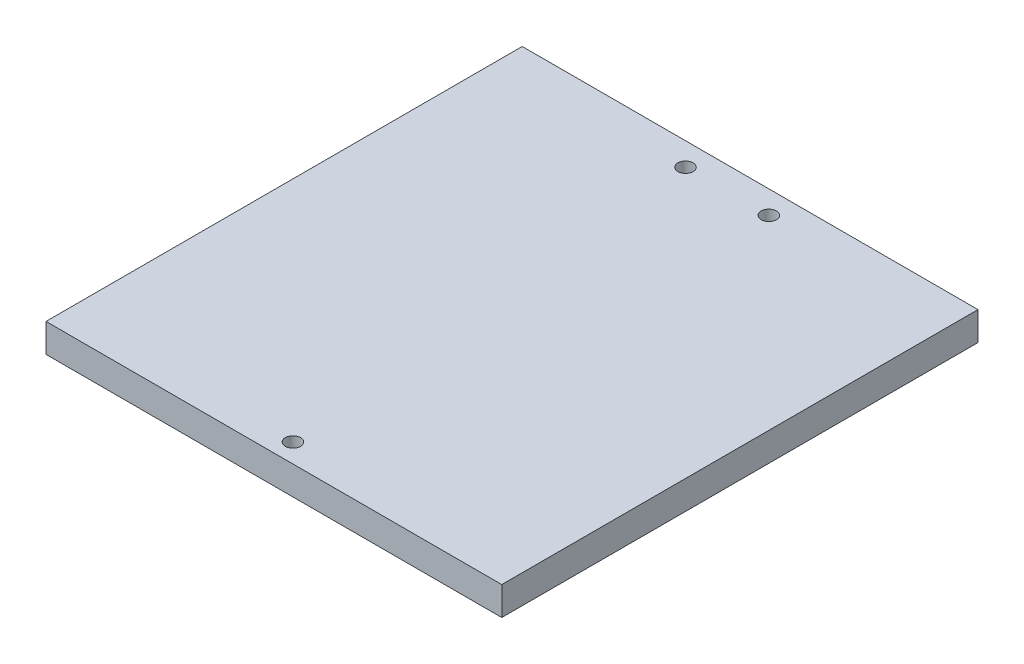
ISO-10303-21;
HEADER;
FILE_DESCRIPTION(('STEP AP214'),'2;1');
FILE_NAME('part.step','',(''),(''),'','','');
FILE_SCHEMA(('AUTOMOTIVE_DESIGN { 1 0 10303 214 1 1 1 1 }'));
ENDSEC;
DATA;
#1=APPLICATION_CONTEXT('core data for automotive mechanical design processes');
#2=APPLICATION_PROTOCOL_DEFINITION('international standard','automotive_design',2000,#1);
#3=PRODUCT_CONTEXT('',#1,'mechanical');
#4=PRODUCT('Part','Part','',(#3));
#5=PRODUCT_RELATED_PRODUCT_CATEGORY('part','',(#4));
#6=PRODUCT_DEFINITION_FORMATION('','',#4);
#7=PRODUCT_DEFINITION_CONTEXT('part definition',#1,'design');
#8=PRODUCT_DEFINITION('design','',#6,#7);
#9=PRODUCT_DEFINITION_SHAPE('','',#8);
#10=(LENGTH_UNIT() NAMED_UNIT(*) SI_UNIT(.MILLI.,.METRE.));
#11=(NAMED_UNIT(*) PLANE_ANGLE_UNIT() SI_UNIT($,.RADIAN.));
#12=(NAMED_UNIT(*) SI_UNIT($,.STERADIAN.) SOLID_ANGLE_UNIT());
#13=UNCERTAINTY_MEASURE_WITH_UNIT(LENGTH_MEASURE(1.E-05),#10,'distance_accuracy_value','');
#14=(GEOMETRIC_REPRESENTATION_CONTEXT(3) GLOBAL_UNCERTAINTY_ASSIGNED_CONTEXT((#13)) GLOBAL_UNIT_ASSIGNED_CONTEXT((#10,
#11,#12)) REPRESENTATION_CONTEXT('',''));
#15=CARTESIAN_POINT('',(0.,0.,0.));
#16=DIRECTION('',(0.,0.,1.));
#17=DIRECTION('',(1.,0.,0.));
#18=AXIS2_PLACEMENT_3D('',#15,#16,#17);
#19=CARTESIAN_POINT('',(0.,3.,0.));
#20=DIRECTION('',(0.,-1.,0.));
#21=DIRECTION('',(0.,0.,-1.));
#22=AXIS2_PLACEMENT_3D('',#19,#20,#21);
#23=PLANE('',#22);
#24=DIRECTION('',(0.,0.,-1.));
#25=VECTOR('',#24,1.);
#26=CARTESIAN_POINT('',(47.85,3.,50.));
#27=LINE('',#26,#25);
#28=CARTESIAN_POINT('',(47.85,3.,50.));
#29=VERTEX_POINT('',#28);
#30=CARTESIAN_POINT('',(47.85,3.,-50.));
#31=VERTEX_POINT('',#30);
#32=EDGE_CURVE('E84',#29,#31,#27,.T.);
#33=ORIENTED_EDGE('',*,*,#32,.T.);
#34=DIRECTION('',(-1.,0.,0.));
#35=VECTOR('',#34,1.);
#36=CARTESIAN_POINT('',(-47.85,3.,-50.));
#37=LINE('',#36,#35);
#38=CARTESIAN_POINT('',(-47.85,3.,-50.));
#39=VERTEX_POINT('',#38);
#40=EDGE_CURVE('E79',#31,#39,#37,.T.);
#41=ORIENTED_EDGE('',*,*,#40,.T.);
#42=DIRECTION('',(0.,0.,1.));
#43=VECTOR('',#42,1.);
#44=CARTESIAN_POINT('',(-47.85,3.,50.));
#45=LINE('',#44,#43);
#46=CARTESIAN_POINT('',(-47.85,3.,50.));
#47=VERTEX_POINT('',#46);
#48=EDGE_CURVE('E82',#39,#47,#45,.T.);
#49=ORIENTED_EDGE('',*,*,#48,.T.);
#50=DIRECTION('',(1.,0.,0.));
#51=VECTOR('',#50,1.);
#52=CARTESIAN_POINT('',(-47.85,3.,50.));
#53=LINE('',#52,#51);
#54=EDGE_CURVE('E49',#47,#29,#53,.T.);
#55=ORIENTED_EDGE('',*,*,#54,.T.);
#56=EDGE_LOOP('',(#33,#41,#49,#55));
#57=FACE_BOUND('',#56,.T.);
#58=CARTESIAN_POINT('',(-8.75,3.,-45.1813672044761));
#59=DIRECTION('',(0.,1.,0.));
#60=DIRECTION('',(0.,0.,1.));
#61=AXIS2_PLACEMENT_3D('',#58,#59,#60);
#62=CIRCLE('',#61,1.6);
#63=CARTESIAN_POINT('',(-8.75,3.,-43.5813672044761));
#64=VERTEX_POINT('',#63);
#65=EDGE_CURVE('E99',#64,#64,#62,.T.);
#66=ORIENTED_EDGE('',*,*,#65,.F.);
#67=EDGE_LOOP('',(#66));
#68=FACE_BOUND('',#67,.T.);
#69=CARTESIAN_POINT('',(8.75,3.,-45.1813672044761));
#70=DIRECTION('',(0.,1.,0.));
#71=DIRECTION('',(0.,0.,1.));
#72=AXIS2_PLACEMENT_3D('',#69,#70,#71);
#73=CIRCLE('',#72,1.6);
#74=CARTESIAN_POINT('',(8.75,3.,-43.5813672044761));
#75=VERTEX_POINT('',#74);
#76=EDGE_CURVE('E114',#75,#75,#73,.T.);
#77=ORIENTED_EDGE('',*,*,#76,.F.);
#78=EDGE_LOOP('',(#77));
#79=FACE_BOUND('',#78,.T.);
#80=CARTESIAN_POINT('',(0.,3.,46.));
#81=DIRECTION('',(0.,1.,0.));
#82=DIRECTION('',(0.,0.,1.));
#83=AXIS2_PLACEMENT_3D('',#80,#81,#82);
#84=CIRCLE('',#83,1.6);
#85=CARTESIAN_POINT('',(0.,3.,47.6));
#86=VERTEX_POINT('',#85);
#87=EDGE_CURVE('E120',#86,#86,#84,.T.);
#88=ORIENTED_EDGE('',*,*,#87,.F.);
#89=EDGE_LOOP('',(#88));
#90=FACE_BOUND('',#89,.T.);
#91=ADVANCED_FACE('F32',(#57,#68,#79,#90),#23,.F.);
#92=CARTESIAN_POINT('',(0.,-3.,0.));
#93=DIRECTION('',(0.,-1.,0.));
#94=DIRECTION('',(0.,0.,-1.));
#95=AXIS2_PLACEMENT_3D('',#92,#93,#94);
#96=PLANE('',#95);
#97=CARTESIAN_POINT('',(8.75,-3.,-45.1813672044761));
#98=DIRECTION('',(0.,1.,0.));
#99=DIRECTION('',(0.,0.,1.));
#100=AXIS2_PLACEMENT_3D('',#97,#98,#99);
#101=CIRCLE('',#100,1.6);
#102=CARTESIAN_POINT('',(8.75,-3.,-43.5813672044761));
#103=VERTEX_POINT('',#102);
#104=EDGE_CURVE('E117',#103,#103,#101,.T.);
#105=ORIENTED_EDGE('',*,*,#104,.T.);
#106=EDGE_LOOP('',(#105));
#107=FACE_BOUND('',#106,.T.);
#108=DIRECTION('',(0.,0.,-1.));
#109=VECTOR('',#108,1.);
#110=CARTESIAN_POINT('',(47.85,-3.,50.));
#111=LINE('',#110,#109);
#112=CARTESIAN_POINT('',(47.85,-3.,50.));
#113=VERTEX_POINT('',#112);
#114=CARTESIAN_POINT('',(47.85,-3.,-50.));
#115=VERTEX_POINT('',#114);
#116=EDGE_CURVE('E96',#113,#115,#111,.T.);
#117=ORIENTED_EDGE('',*,*,#116,.F.);
#118=DIRECTION('',(1.,0.,0.));
#119=VECTOR('',#118,1.);
#120=CARTESIAN_POINT('',(-47.85,-3.,50.));
#121=LINE('',#120,#119);
#122=CARTESIAN_POINT('',(-47.85,-3.,50.));
#123=VERTEX_POINT('',#122);
#124=EDGE_CURVE('E72',#123,#113,#121,.T.);
#125=ORIENTED_EDGE('',*,*,#124,.F.);
#126=DIRECTION('',(0.,0.,1.));
#127=VECTOR('',#126,1.);
#128=CARTESIAN_POINT('',(-47.85,-3.,50.));
#129=LINE('',#128,#127);
#130=CARTESIAN_POINT('',(-47.85,-3.,-50.));
#131=VERTEX_POINT('',#130);
#132=EDGE_CURVE('E66',#131,#123,#129,.T.);
#133=ORIENTED_EDGE('',*,*,#132,.F.);
#134=DIRECTION('',(-1.,0.,0.));
#135=VECTOR('',#134,1.);
#136=CARTESIAN_POINT('',(-47.85,-3.,-50.));
#137=LINE('',#136,#135);
#138=EDGE_CURVE('E88',#115,#131,#137,.T.);
#139=ORIENTED_EDGE('',*,*,#138,.F.);
#140=EDGE_LOOP('',(#117,#125,#133,#139));
#141=FACE_BOUND('',#140,.T.);
#142=CARTESIAN_POINT('',(-8.75,-3.,-45.1813672044761));
#143=DIRECTION('',(0.,1.,0.));
#144=DIRECTION('',(0.,0.,1.));
#145=AXIS2_PLACEMENT_3D('',#142,#143,#144);
#146=CIRCLE('',#145,1.6);
#147=CARTESIAN_POINT('',(-8.75,-3.,-43.5813672044761));
#148=VERTEX_POINT('',#147);
#149=EDGE_CURVE('E111',#148,#148,#146,.T.);
#150=ORIENTED_EDGE('',*,*,#149,.T.);
#151=EDGE_LOOP('',(#150));
#152=FACE_BOUND('',#151,.T.);
#153=CARTESIAN_POINT('',(0.,-3.,46.));
#154=DIRECTION('',(0.,1.,0.));
#155=DIRECTION('',(0.,0.,1.));
#156=AXIS2_PLACEMENT_3D('',#153,#154,#155);
#157=CIRCLE('',#156,1.6);
#158=CARTESIAN_POINT('',(0.,-3.,47.6));
#159=VERTEX_POINT('',#158);
#160=EDGE_CURVE('E123',#159,#159,#157,.T.);
#161=ORIENTED_EDGE('',*,*,#160,.T.);
#162=EDGE_LOOP('',(#161));
#163=FACE_BOUND('',#162,.T.);
#164=ADVANCED_FACE('F107',(#107,#141,#152,#163),#96,.T.);
#165=CARTESIAN_POINT('',(47.85,3.,50.));
#166=DIRECTION('',(-1.,0.,0.));
#167=DIRECTION('',(0.,0.,1.));
#168=AXIS2_PLACEMENT_3D('',#165,#166,#167);
#169=PLANE('',#168);
#170=ORIENTED_EDGE('',*,*,#116,.T.);
#171=DIRECTION('',(0.,-1.,0.));
#172=VECTOR('',#171,1.);
#173=CARTESIAN_POINT('',(47.85,3.,-50.));
#174=LINE('',#173,#172);
#175=EDGE_CURVE('E11',#31,#115,#174,.T.);
#176=ORIENTED_EDGE('',*,*,#175,.F.);
#177=ORIENTED_EDGE('',*,*,#32,.F.);
#178=DIRECTION('',(0.,-1.,0.));
#179=VECTOR('',#178,1.);
#180=CARTESIAN_POINT('',(47.85,3.,50.));
#181=LINE('',#180,#179);
#182=EDGE_CURVE('E92',#29,#113,#181,.T.);
#183=ORIENTED_EDGE('',*,*,#182,.T.);
#184=EDGE_LOOP('',(#170,#176,#177,#183));
#185=FACE_BOUND('',#184,.T.);
#186=ADVANCED_FACE('F34',(#185),#169,.F.);
#187=CARTESIAN_POINT('',(-47.85,3.,-50.));
#188=DIRECTION('',(0.,0.,1.));
#189=DIRECTION('',(1.,0.,0.));
#190=AXIS2_PLACEMENT_3D('',#187,#188,#189);
#191=PLANE('',#190);
#192=ORIENTED_EDGE('',*,*,#138,.T.);
#193=DIRECTION('',(0.,-1.,0.));
#194=VECTOR('',#193,1.);
#195=CARTESIAN_POINT('',(-47.85,3.,-50.));
#196=LINE('',#195,#194);
#197=EDGE_CURVE('E41',#39,#131,#196,.T.);
#198=ORIENTED_EDGE('',*,*,#197,.F.);
#199=ORIENTED_EDGE('',*,*,#40,.F.);
#200=ORIENTED_EDGE('',*,*,#175,.T.);
#201=EDGE_LOOP('',(#192,#198,#199,#200));
#202=FACE_BOUND('',#201,.T.);
#203=ADVANCED_FACE('F87',(#202),#191,.F.);
#204=CARTESIAN_POINT('',(-47.85,3.,50.));
#205=DIRECTION('',(1.,0.,0.));
#206=DIRECTION('',(0.,0.,-1.));
#207=AXIS2_PLACEMENT_3D('',#204,#205,#206);
#208=PLANE('',#207);
#209=ORIENTED_EDGE('',*,*,#132,.T.);
#210=DIRECTION('',(0.,-1.,0.));
#211=VECTOR('',#210,1.);
#212=CARTESIAN_POINT('',(-47.85,3.,50.));
#213=LINE('',#212,#211);
#214=EDGE_CURVE('E89',#47,#123,#213,.T.);
#215=ORIENTED_EDGE('',*,*,#214,.F.);
#216=ORIENTED_EDGE('',*,*,#48,.F.);
#217=ORIENTED_EDGE('',*,*,#197,.T.);
#218=EDGE_LOOP('',(#209,#215,#216,#217));
#219=FACE_BOUND('',#218,.T.);
#220=ADVANCED_FACE('F90',(#219),#208,.F.);
#221=CARTESIAN_POINT('',(-47.85,3.,50.));
#222=DIRECTION('',(0.,0.,-1.));
#223=DIRECTION('',(-1.,0.,0.));
#224=AXIS2_PLACEMENT_3D('',#221,#222,#223);
#225=PLANE('',#224);
#226=ORIENTED_EDGE('',*,*,#124,.T.);
#227=ORIENTED_EDGE('',*,*,#182,.F.);
#228=ORIENTED_EDGE('',*,*,#54,.F.);
#229=ORIENTED_EDGE('',*,*,#214,.T.);
#230=EDGE_LOOP('',(#226,#227,#228,#229));
#231=FACE_BOUND('',#230,.T.);
#232=ADVANCED_FACE('F104',(#231),#225,.F.);
#233=CARTESIAN_POINT('',(-8.75,3.,-45.1813672044761));
#234=DIRECTION('',(0.,-1.,0.));
#235=DIRECTION('',(0.,0.,-1.));
#236=AXIS2_PLACEMENT_3D('',#233,#234,#235);
#237=CYLINDRICAL_SURFACE('',#236,1.6);
#238=ORIENTED_EDGE('',*,*,#65,.T.);
#239=EDGE_LOOP('',(#238));
#240=FACE_BOUND('',#239,.T.);
#241=ORIENTED_EDGE('',*,*,#149,.F.);
#242=EDGE_LOOP('',(#241));
#243=FACE_BOUND('',#242,.T.);
#244=ADVANCED_FACE('F140',(#240,#243),#237,.F.);
#245=CARTESIAN_POINT('',(8.75,3.,-45.1813672044761));
#246=DIRECTION('',(0.,-1.,0.));
#247=DIRECTION('',(0.,0.,-1.));
#248=AXIS2_PLACEMENT_3D('',#245,#246,#247);
#249=CYLINDRICAL_SURFACE('',#248,1.6);
#250=ORIENTED_EDGE('',*,*,#76,.T.);
#251=EDGE_LOOP('',(#250));
#252=FACE_BOUND('',#251,.T.);
#253=ORIENTED_EDGE('',*,*,#104,.F.);
#254=EDGE_LOOP('',(#253));
#255=FACE_BOUND('',#254,.T.);
#256=ADVANCED_FACE('F186',(#252,#255),#249,.F.);
#257=CARTESIAN_POINT('',(0.,3.,46.));
#258=DIRECTION('',(0.,-1.,0.));
#259=DIRECTION('',(0.,0.,-1.));
#260=AXIS2_PLACEMENT_3D('',#257,#258,#259);
#261=CYLINDRICAL_SURFACE('',#260,1.6);
#262=ORIENTED_EDGE('',*,*,#87,.T.);
#263=EDGE_LOOP('',(#262));
#264=FACE_BOUND('',#263,.T.);
#265=ORIENTED_EDGE('',*,*,#160,.F.);
#266=EDGE_LOOP('',(#265));
#267=FACE_BOUND('',#266,.T.);
#268=ADVANCED_FACE('F129',(#264,#267),#261,.F.);
#269=CLOSED_SHELL('',(#91,#164,#186,#203,#220,#232,#244,#256,#268));
#270=MANIFOLD_SOLID_BREP('B2',#269);
#271=ADVANCED_BREP_SHAPE_REPRESENTATION('',(#18,#270),#14);
#272=SHAPE_DEFINITION_REPRESENTATION(#9,#271);
ENDSEC;
END-ISO-10303-21;
